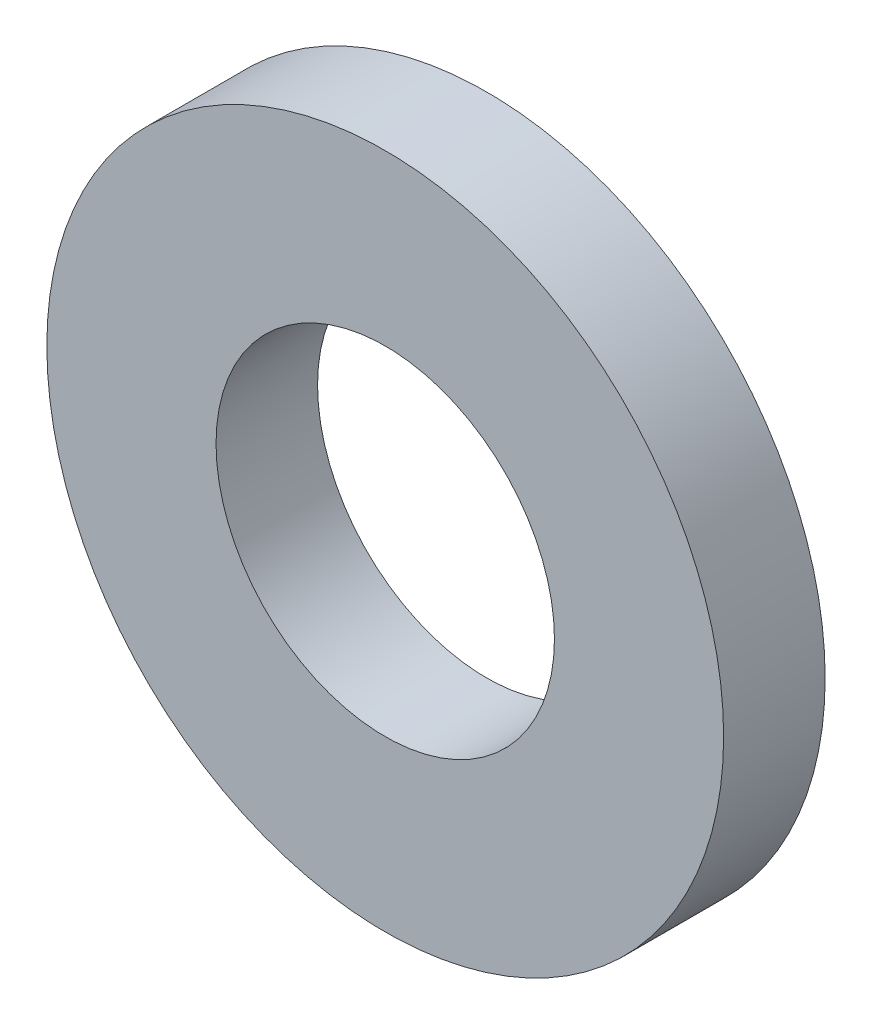
ISO-10303-21;
HEADER;
FILE_DESCRIPTION(('STEP AP214'),'2;1');
FILE_NAME('part.step','',(''),(''),'','','');
FILE_SCHEMA(('AUTOMOTIVE_DESIGN { 1 0 10303 214 1 1 1 1 }'));
ENDSEC;
DATA;
#1=APPLICATION_CONTEXT('core data for automotive mechanical design processes');
#2=APPLICATION_PROTOCOL_DEFINITION('international standard','automotive_design',2000,#1);
#3=PRODUCT_CONTEXT('',#1,'mechanical');
#4=PRODUCT('Part','Part','',(#3));
#5=PRODUCT_RELATED_PRODUCT_CATEGORY('part','',(#4));
#6=PRODUCT_DEFINITION_FORMATION('','',#4);
#7=PRODUCT_DEFINITION_CONTEXT('part definition',#1,'design');
#8=PRODUCT_DEFINITION('design','',#6,#7);
#9=PRODUCT_DEFINITION_SHAPE('','',#8);
#10=(LENGTH_UNIT() NAMED_UNIT(*) SI_UNIT(.MILLI.,.METRE.));
#11=(NAMED_UNIT(*) PLANE_ANGLE_UNIT() SI_UNIT($,.RADIAN.));
#12=(NAMED_UNIT(*) SI_UNIT($,.STERADIAN.) SOLID_ANGLE_UNIT());
#13=UNCERTAINTY_MEASURE_WITH_UNIT(LENGTH_MEASURE(1.E-05),#10,'distance_accuracy_value','');
#14=(GEOMETRIC_REPRESENTATION_CONTEXT(3) GLOBAL_UNCERTAINTY_ASSIGNED_CONTEXT((#13)) GLOBAL_UNIT_ASSIGNED_CONTEXT((#10,
#11,#12)) REPRESENTATION_CONTEXT('',''));
#15=CARTESIAN_POINT('',(0.,0.,0.));
#16=DIRECTION('',(0.,0.,1.));
#17=DIRECTION('',(1.,0.,0.));
#18=AXIS2_PLACEMENT_3D('',#15,#16,#17);
#19=CARTESIAN_POINT('',(0.,0.,0.9));
#20=DIRECTION('',(0.,0.,1.));
#21=DIRECTION('',(1.,0.,0.));
#22=AXIS2_PLACEMENT_3D('',#19,#20,#21);
#23=PLANE('',#22);
#24=CARTESIAN_POINT('',(0.,0.,0.9));
#25=DIRECTION('',(0.,0.,1.));
#26=DIRECTION('',(1.,0.,0.));
#27=AXIS2_PLACEMENT_3D('',#24,#25,#26);
#28=CIRCLE('',#27,3.);
#29=CARTESIAN_POINT('',(3.,0.,0.9));
#30=VERTEX_POINT('',#29);
#31=EDGE_CURVE('E10',#30,#30,#28,.T.);
#32=ORIENTED_EDGE('',*,*,#31,.T.);
#33=EDGE_LOOP('',(#32));
#34=FACE_BOUND('',#33,.T.);
#35=CARTESIAN_POINT('',(0.,0.,0.9));
#36=DIRECTION('',(0.,0.,1.));
#37=DIRECTION('',(1.,0.,0.));
#38=AXIS2_PLACEMENT_3D('',#35,#36,#37);
#39=CIRCLE('',#38,1.5);
#40=CARTESIAN_POINT('',(1.5,0.,0.9));
#41=VERTEX_POINT('',#40);
#42=EDGE_CURVE('E44',#41,#41,#39,.T.);
#43=ORIENTED_EDGE('',*,*,#42,.F.);
#44=EDGE_LOOP('',(#43));
#45=FACE_BOUND('',#44,.T.);
#46=ADVANCED_FACE('F33',(#34,#45),#23,.T.);
#47=CARTESIAN_POINT('',(0.,0.,0.));
#48=DIRECTION('',(0.,0.,1.));
#49=DIRECTION('',(1.,0.,0.));
#50=AXIS2_PLACEMENT_3D('',#47,#48,#49);
#51=PLANE('',#50);
#52=CARTESIAN_POINT('',(0.,0.,0.));
#53=DIRECTION('',(0.,0.,1.));
#54=DIRECTION('',(1.,0.,0.));
#55=AXIS2_PLACEMENT_3D('',#52,#53,#54);
#56=CIRCLE('',#55,3.);
#57=CARTESIAN_POINT('',(3.,0.,0.));
#58=VERTEX_POINT('',#57);
#59=EDGE_CURVE('E37',#58,#58,#56,.T.);
#60=ORIENTED_EDGE('',*,*,#59,.F.);
#61=EDGE_LOOP('',(#60));
#62=FACE_BOUND('',#61,.T.);
#63=CARTESIAN_POINT('',(0.,0.,0.));
#64=DIRECTION('',(0.,0.,1.));
#65=DIRECTION('',(1.,0.,0.));
#66=AXIS2_PLACEMENT_3D('',#63,#64,#65);
#67=CIRCLE('',#66,1.5);
#68=CARTESIAN_POINT('',(1.5,0.,0.));
#69=VERTEX_POINT('',#68);
#70=EDGE_CURVE('E46',#69,#69,#67,.T.);
#71=ORIENTED_EDGE('',*,*,#70,.T.);
#72=EDGE_LOOP('',(#71));
#73=FACE_BOUND('',#72,.T.);
#74=ADVANCED_FACE('F56',(#62,#73),#51,.F.);
#75=CARTESIAN_POINT('',(0.,0.,0.9));
#76=DIRECTION('',(0.,0.,-1.));
#77=DIRECTION('',(-1.,0.,0.));
#78=AXIS2_PLACEMENT_3D('',#75,#76,#77);
#79=CYLINDRICAL_SURFACE('',#78,3.);
#80=ORIENTED_EDGE('',*,*,#31,.F.);
#81=EDGE_LOOP('',(#80));
#82=FACE_BOUND('',#81,.T.);
#83=ORIENTED_EDGE('',*,*,#59,.T.);
#84=EDGE_LOOP('',(#83));
#85=FACE_BOUND('',#84,.T.);
#86=ADVANCED_FACE('F35',(#82,#85),#79,.T.);
#87=CARTESIAN_POINT('',(0.,0.,0.9));
#88=DIRECTION('',(0.,0.,-1.));
#89=DIRECTION('',(-1.,0.,0.));
#90=AXIS2_PLACEMENT_3D('',#87,#88,#89);
#91=CYLINDRICAL_SURFACE('',#90,1.5);
#92=ORIENTED_EDGE('',*,*,#42,.T.);
#93=EDGE_LOOP('',(#92));
#94=FACE_BOUND('',#93,.T.);
#95=ORIENTED_EDGE('',*,*,#70,.F.);
#96=EDGE_LOOP('',(#95));
#97=FACE_BOUND('',#96,.T.);
#98=ADVANCED_FACE('F52',(#94,#97),#91,.F.);
#99=CLOSED_SHELL('',(#46,#74,#86,#98));
#100=MANIFOLD_SOLID_BREP('B2',#99);
#101=ADVANCED_BREP_SHAPE_REPRESENTATION('',(#18,#100),#14);
#102=SHAPE_DEFINITION_REPRESENTATION(#9,#101);
ENDSEC;
END-ISO-10303-21;
